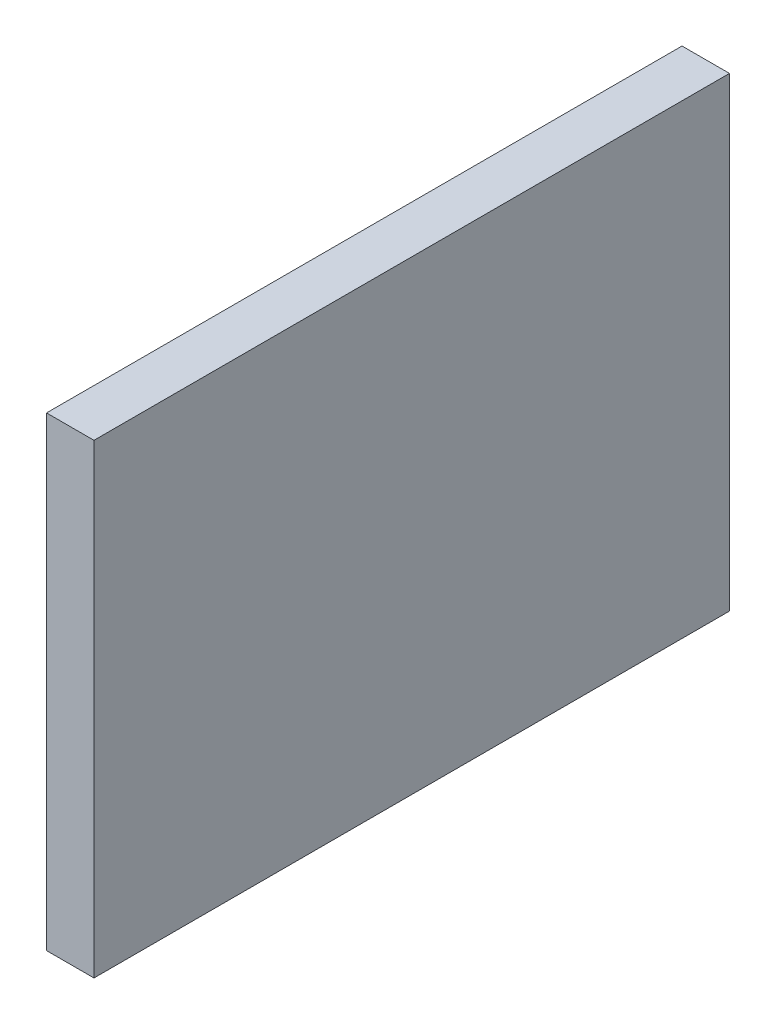
ISO-10303-21;
HEADER;
FILE_DESCRIPTION(('STEP AP214'),'2;1');
FILE_NAME('part.step','',(''),(''),'','','');
FILE_SCHEMA(('AUTOMOTIVE_DESIGN { 1 0 10303 214 1 1 1 1 }'));
ENDSEC;
DATA;
#1=APPLICATION_CONTEXT('core data for automotive mechanical design processes');
#2=APPLICATION_PROTOCOL_DEFINITION('international standard','automotive_design',2000,#1);
#3=PRODUCT_CONTEXT('',#1,'mechanical');
#4=PRODUCT('Part','Part','',(#3));
#5=PRODUCT_RELATED_PRODUCT_CATEGORY('part','',(#4));
#6=PRODUCT_DEFINITION_FORMATION('','',#4);
#7=PRODUCT_DEFINITION_CONTEXT('part definition',#1,'design');
#8=PRODUCT_DEFINITION('design','',#6,#7);
#9=PRODUCT_DEFINITION_SHAPE('','',#8);
#10=(LENGTH_UNIT() NAMED_UNIT(*) SI_UNIT(.MILLI.,.METRE.));
#11=(NAMED_UNIT(*) PLANE_ANGLE_UNIT() SI_UNIT($,.RADIAN.));
#12=(NAMED_UNIT(*) SI_UNIT($,.STERADIAN.) SOLID_ANGLE_UNIT());
#13=UNCERTAINTY_MEASURE_WITH_UNIT(LENGTH_MEASURE(1.E-05),#10,'distance_accuracy_value','');
#14=(GEOMETRIC_REPRESENTATION_CONTEXT(3) GLOBAL_UNCERTAINTY_ASSIGNED_CONTEXT((#13)) GLOBAL_UNIT_ASSIGNED_CONTEXT((#10,
#11,#12)) REPRESENTATION_CONTEXT('',''));
#15=CARTESIAN_POINT('',(0.,0.,0.));
#16=DIRECTION('',(0.,0.,1.));
#17=DIRECTION('',(1.,0.,0.));
#18=AXIS2_PLACEMENT_3D('',#15,#16,#17);
#19=CARTESIAN_POINT('',(-11.,53.975,-73.66));
#20=DIRECTION('',(0.,0.,-1.));
#21=DIRECTION('',(0.,1.,0.));
#22=AXIS2_PLACEMENT_3D('',#19,#20,#21);
#23=PLANE('',#22);
#24=DIRECTION('',(0.,1.,0.));
#25=VECTOR('',#24,1.);
#26=CARTESIAN_POINT('',(0.,53.975,-73.66));
#27=LINE('',#26,#25);
#28=CARTESIAN_POINT('',(0.,-53.975,-73.66));
#29=VERTEX_POINT('',#28);
#30=CARTESIAN_POINT('',(0.,53.975,-73.66));
#31=VERTEX_POINT('',#30);
#32=EDGE_CURVE('E96',#29,#31,#27,.T.);
#33=ORIENTED_EDGE('',*,*,#32,.F.);
#34=DIRECTION('',(1.,0.,0.));
#35=VECTOR('',#34,1.);
#36=CARTESIAN_POINT('',(-11.,-53.975,-73.66));
#37=LINE('',#36,#35);
#38=CARTESIAN_POINT('',(-11.,-53.975,-73.66));
#39=VERTEX_POINT('',#38);
#40=EDGE_CURVE('E11',#39,#29,#37,.T.);
#41=ORIENTED_EDGE('',*,*,#40,.F.);
#42=DIRECTION('',(0.,1.,0.));
#43=VECTOR('',#42,1.);
#44=CARTESIAN_POINT('',(-11.,53.975,-73.66));
#45=LINE('',#44,#43);
#46=CARTESIAN_POINT('',(-11.,53.975,-73.66));
#47=VERTEX_POINT('',#46);
#48=EDGE_CURVE('E90',#39,#47,#45,.T.);
#49=ORIENTED_EDGE('',*,*,#48,.T.);
#50=DIRECTION('',(1.,0.,0.));
#51=VECTOR('',#50,1.);
#52=CARTESIAN_POINT('',(-11.,53.975,-73.66));
#53=LINE('',#52,#51);
#54=EDGE_CURVE('E35',#47,#31,#53,.T.);
#55=ORIENTED_EDGE('',*,*,#54,.T.);
#56=EDGE_LOOP('',(#33,#41,#49,#55));
#57=FACE_BOUND('',#56,.T.);
#58=ADVANCED_FACE('F32',(#57),#23,.T.);
#59=CARTESIAN_POINT('',(-11.,-53.975,-73.66));
#60=DIRECTION('',(0.,-1.,0.));
#61=DIRECTION('',(0.,0.,-1.));
#62=AXIS2_PLACEMENT_3D('',#59,#60,#61);
#63=PLANE('',#62);
#64=DIRECTION('',(0.,0.,-1.));
#65=VECTOR('',#64,1.);
#66=CARTESIAN_POINT('',(0.,-53.975,-73.66));
#67=LINE('',#66,#65);
#68=CARTESIAN_POINT('',(0.,-53.975,73.66));
#69=VERTEX_POINT('',#68);
#70=EDGE_CURVE('E92',#69,#29,#67,.T.);
#71=ORIENTED_EDGE('',*,*,#70,.F.);
#72=DIRECTION('',(1.,0.,0.));
#73=VECTOR('',#72,1.);
#74=CARTESIAN_POINT('',(-11.,-53.975,73.66));
#75=LINE('',#74,#73);
#76=CARTESIAN_POINT('',(-11.,-53.975,73.66));
#77=VERTEX_POINT('',#76);
#78=EDGE_CURVE('E41',#77,#69,#75,.T.);
#79=ORIENTED_EDGE('',*,*,#78,.F.);
#80=DIRECTION('',(0.,0.,-1.));
#81=VECTOR('',#80,1.);
#82=CARTESIAN_POINT('',(-11.,-53.975,-73.66));
#83=LINE('',#82,#81);
#84=EDGE_CURVE('E87',#77,#39,#83,.T.);
#85=ORIENTED_EDGE('',*,*,#84,.T.);
#86=ORIENTED_EDGE('',*,*,#40,.T.);
#87=EDGE_LOOP('',(#71,#79,#85,#86));
#88=FACE_BOUND('',#87,.T.);
#89=ADVANCED_FACE('F106',(#88),#63,.T.);
#90=CARTESIAN_POINT('',(-11.,53.975,73.66));
#91=DIRECTION('',(0.,0.,1.));
#92=DIRECTION('',(0.,-1.,0.));
#93=AXIS2_PLACEMENT_3D('',#90,#91,#92);
#94=PLANE('',#93);
#95=DIRECTION('',(0.,-1.,0.));
#96=VECTOR('',#95,1.);
#97=CARTESIAN_POINT('',(0.,53.975,73.66));
#98=LINE('',#97,#96);
#99=CARTESIAN_POINT('',(0.,53.975,73.66));
#100=VERTEX_POINT('',#99);
#101=EDGE_CURVE('E82',#100,#69,#98,.T.);
#102=ORIENTED_EDGE('',*,*,#101,.F.);
#103=DIRECTION('',(1.,0.,0.));
#104=VECTOR('',#103,1.);
#105=CARTESIAN_POINT('',(-11.,53.975,73.66));
#106=LINE('',#105,#104);
#107=CARTESIAN_POINT('',(-11.,53.975,73.66));
#108=VERTEX_POINT('',#107);
#109=EDGE_CURVE('E77',#108,#100,#106,.T.);
#110=ORIENTED_EDGE('',*,*,#109,.F.);
#111=DIRECTION('',(0.,-1.,0.));
#112=VECTOR('',#111,1.);
#113=CARTESIAN_POINT('',(-11.,53.975,73.66));
#114=LINE('',#113,#112);
#115=EDGE_CURVE('E80',#108,#77,#114,.T.);
#116=ORIENTED_EDGE('',*,*,#115,.T.);
#117=ORIENTED_EDGE('',*,*,#78,.T.);
#118=EDGE_LOOP('',(#102,#110,#116,#117));
#119=FACE_BOUND('',#118,.T.);
#120=ADVANCED_FACE('F79',(#119),#94,.T.);
#121=CARTESIAN_POINT('',(-11.,53.975,-73.66));
#122=DIRECTION('',(0.,1.,0.));
#123=DIRECTION('',(0.,0.,1.));
#124=AXIS2_PLACEMENT_3D('',#121,#122,#123);
#125=PLANE('',#124);
#126=DIRECTION('',(0.,0.,1.));
#127=VECTOR('',#126,1.);
#128=CARTESIAN_POINT('',(0.,53.975,-73.66));
#129=LINE('',#128,#127);
#130=EDGE_CURVE('E99',#31,#100,#129,.T.);
#131=ORIENTED_EDGE('',*,*,#130,.F.);
#132=ORIENTED_EDGE('',*,*,#54,.F.);
#133=DIRECTION('',(0.,0.,1.));
#134=VECTOR('',#133,1.);
#135=CARTESIAN_POINT('',(-11.,53.975,-73.66));
#136=LINE('',#135,#134);
#137=EDGE_CURVE('E86',#47,#108,#136,.T.);
#138=ORIENTED_EDGE('',*,*,#137,.T.);
#139=ORIENTED_EDGE('',*,*,#109,.T.);
#140=EDGE_LOOP('',(#131,#132,#138,#139));
#141=FACE_BOUND('',#140,.T.);
#142=ADVANCED_FACE('F89',(#141),#125,.T.);
#143=CARTESIAN_POINT('',(-11.,-53.975,-73.66));
#144=DIRECTION('',(-1.,0.,0.));
#145=DIRECTION('',(0.,0.,1.));
#146=AXIS2_PLACEMENT_3D('',#143,#144,#145);
#147=PLANE('',#146);
#148=ORIENTED_EDGE('',*,*,#48,.F.);
#149=ORIENTED_EDGE('',*,*,#84,.F.);
#150=ORIENTED_EDGE('',*,*,#115,.F.);
#151=ORIENTED_EDGE('',*,*,#137,.F.);
#152=EDGE_LOOP('',(#148,#149,#150,#151));
#153=FACE_BOUND('',#152,.T.);
#154=ADVANCED_FACE('F85',(#153),#147,.T.);
#155=CARTESIAN_POINT('',(0.,-53.975,-73.66));
#156=DIRECTION('',(-1.,0.,0.));
#157=DIRECTION('',(0.,0.,1.));
#158=AXIS2_PLACEMENT_3D('',#155,#156,#157);
#159=PLANE('',#158);
#160=ORIENTED_EDGE('',*,*,#32,.T.);
#161=ORIENTED_EDGE('',*,*,#130,.T.);
#162=ORIENTED_EDGE('',*,*,#101,.T.);
#163=ORIENTED_EDGE('',*,*,#70,.T.);
#164=EDGE_LOOP('',(#160,#161,#162,#163));
#165=FACE_BOUND('',#164,.T.);
#166=ADVANCED_FACE('F105',(#165),#159,.F.);
#167=CLOSED_SHELL('',(#58,#89,#120,#142,#154,#166));
#168=MANIFOLD_SOLID_BREP('B2',#167);
#169=ADVANCED_BREP_SHAPE_REPRESENTATION('',(#18,#168),#14);
#170=SHAPE_DEFINITION_REPRESENTATION(#9,#169);
ENDSEC;
END-ISO-10303-21;
